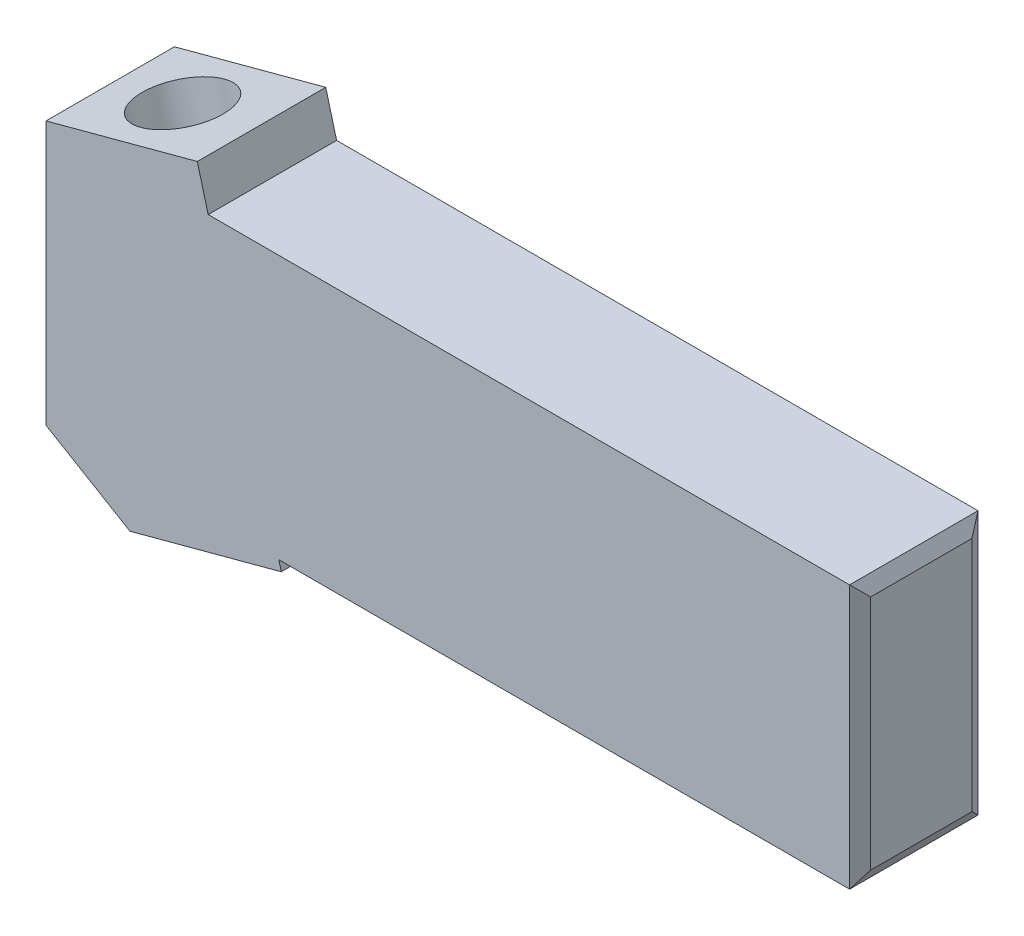
ISO-10303-21;
HEADER;
FILE_DESCRIPTION(('STEP AP214'),'2;1');
FILE_NAME('part.step','',(''),(''),'','','');
FILE_SCHEMA(('AUTOMOTIVE_DESIGN { 1 0 10303 214 1 1 1 1 }'));
ENDSEC;
DATA;
#1=APPLICATION_CONTEXT('core data for automotive mechanical design processes');
#2=APPLICATION_PROTOCOL_DEFINITION('international standard','automotive_design',2000,#1);
#3=PRODUCT_CONTEXT('',#1,'mechanical');
#4=PRODUCT('Part','Part','',(#3));
#5=PRODUCT_RELATED_PRODUCT_CATEGORY('part','',(#4));
#6=PRODUCT_DEFINITION_FORMATION('','',#4);
#7=PRODUCT_DEFINITION_CONTEXT('part definition',#1,'design');
#8=PRODUCT_DEFINITION('design','',#6,#7);
#9=PRODUCT_DEFINITION_SHAPE('','',#8);
#10=(LENGTH_UNIT() NAMED_UNIT(*) SI_UNIT(.MILLI.,.METRE.));
#11=(NAMED_UNIT(*) PLANE_ANGLE_UNIT() SI_UNIT($,.RADIAN.));
#12=(NAMED_UNIT(*) SI_UNIT($,.STERADIAN.) SOLID_ANGLE_UNIT());
#13=UNCERTAINTY_MEASURE_WITH_UNIT(LENGTH_MEASURE(1.E-05),#10,'distance_accuracy_value','');
#14=(GEOMETRIC_REPRESENTATION_CONTEXT(3) GLOBAL_UNCERTAINTY_ASSIGNED_CONTEXT((#13)) GLOBAL_UNIT_ASSIGNED_CONTEXT((#10,
#11,#12)) REPRESENTATION_CONTEXT('',''));
#15=CARTESIAN_POINT('',(0.,0.,0.));
#16=DIRECTION('',(0.,0.,1.));
#17=DIRECTION('',(1.,0.,0.));
#18=AXIS2_PLACEMENT_3D('',#15,#16,#17);
#19=CARTESIAN_POINT('',(0.,9.5,0.));
#20=DIRECTION('',(1.,0.,0.));
#21=DIRECTION('',(0.,0.,-1.));
#22=AXIS2_PLACEMENT_3D('',#19,#20,#21);
#23=PLANE('',#22);
#24=DIRECTION('',(0.,-1.,0.));
#25=VECTOR('',#24,1.);
#26=CARTESIAN_POINT('',(0.,9.5,-9.5));
#27=LINE('',#26,#25);
#28=CARTESIAN_POINT('',(0.,9.5,-9.5));
#29=VERTEX_POINT('',#28);
#30=CARTESIAN_POINT('',(0.,-10.,-9.5));
#31=VERTEX_POINT('',#30);
#32=EDGE_CURVE('E173',#29,#31,#27,.T.);
#33=ORIENTED_EDGE('',*,*,#32,.T.);
#34=DIRECTION('',(0.,0.,1.));
#35=VECTOR('',#34,1.);
#36=CARTESIAN_POINT('',(0.,-10.,0.));
#37=LINE('',#36,#35);
#38=CARTESIAN_POINT('',(0.,-10.,0.));
#39=VERTEX_POINT('',#38);
#40=EDGE_CURVE('E215',#31,#39,#37,.T.);
#41=ORIENTED_EDGE('',*,*,#40,.T.);
#42=DIRECTION('',(0.,-1.,0.));
#43=VECTOR('',#42,1.);
#44=CARTESIAN_POINT('',(0.,9.5,0.));
#45=LINE('',#44,#43);
#46=CARTESIAN_POINT('',(0.,9.5,0.));
#47=VERTEX_POINT('',#46);
#48=EDGE_CURVE('E134',#47,#39,#45,.T.);
#49=ORIENTED_EDGE('',*,*,#48,.F.);
#50=DIRECTION('',(0.,0.,1.));
#51=VECTOR('',#50,1.);
#52=CARTESIAN_POINT('',(0.,9.5,0.));
#53=LINE('',#52,#51);
#54=EDGE_CURVE('E165',#29,#47,#53,.T.);
#55=ORIENTED_EDGE('',*,*,#54,.F.);
#56=EDGE_LOOP('',(#33,#41,#49,#55));
#57=FACE_BOUND('',#56,.T.);
#58=ADVANCED_FACE('F33',(#57),#23,.F.);
#59=CARTESIAN_POINT('',(0.,9.5,0.));
#60=DIRECTION('',(0.,0.,-1.));
#61=DIRECTION('',(-1.,0.,0.));
#62=AXIS2_PLACEMENT_3D('',#59,#60,#61);
#63=PLANE('',#62);
#64=DIRECTION('',(1.,0.,0.));
#65=VECTOR('',#64,1.);
#66=CARTESIAN_POINT('',(0.,-10.,0.));
#67=LINE('',#66,#65);
#68=CARTESIAN_POINT('',(17.2228145805415,-10.,0.));
#69=VERTEX_POINT('',#68);
#70=CARTESIAN_POINT('',(59.4456909485472,-10.,0.));
#71=VERTEX_POINT('',#70);
#72=EDGE_CURVE('E217',#69,#71,#67,.T.);
#73=ORIENTED_EDGE('',*,*,#72,.T.);
#74=DIRECTION('',(0.,1.,0.));
#75=VECTOR('',#74,1.);
#76=CARTESIAN_POINT('',(59.4456909485472,9.5,0.));
#77=LINE('',#76,#75);
#78=CARTESIAN_POINT('',(59.4456909485472,9.5,0.));
#79=VERTEX_POINT('',#78);
#80=EDGE_CURVE('E192',#71,#79,#77,.T.);
#81=ORIENTED_EDGE('',*,*,#80,.T.);
#82=DIRECTION('',(1.,0.,0.));
#83=VECTOR('',#82,1.);
#84=CARTESIAN_POINT('',(0.,9.5,0.));
#85=LINE('',#84,#83);
#86=CARTESIAN_POINT('',(11.9978053281345,9.5,0.));
#87=VERTEX_POINT('',#86);
#88=EDGE_CURVE('E168',#87,#79,#85,.T.);
#89=ORIENTED_EDGE('',*,*,#88,.F.);
#90=DIRECTION('',(-0.258819045102523,0.965925826289068,0.));
#91=VECTOR('',#90,1.);
#92=CARTESIAN_POINT('',(17.4057618484402,-10.682768498904,0.));
#93=LINE('',#92,#91);
#94=CARTESIAN_POINT('',(11.1941047659796,12.4994513320337,0.));
#95=VERTEX_POINT('',#94);
#96=EDGE_CURVE('E126',#87,#95,#93,.T.);
#97=ORIENTED_EDGE('',*,*,#96,.T.);
#98=DIRECTION('',(0.965925826289068,0.258819045102523,0.));
#99=VECTOR('',#98,1.);
#100=CARTESIAN_POINT('',(0.,9.5,0.));
#101=LINE('',#100,#99);
#102=EDGE_CURVE('E154',#47,#95,#101,.T.);
#103=ORIENTED_EDGE('',*,*,#102,.F.);
#104=ORIENTED_EDGE('',*,*,#48,.T.);
#105=DIRECTION('',(-0.860216341580518,0.509929255561818,0.));
#106=VECTOR('',#105,1.);
#107=CARTESIAN_POINT('',(6.21165708246054,-13.6822198309376,0.));
#108=LINE('',#107,#106);
#109=CARTESIAN_POINT('',(6.21165708246054,-13.6822198309376,0.));
#110=VERTEX_POINT('',#109);
#111=EDGE_CURVE('E120',#110,#39,#108,.T.);
#112=ORIENTED_EDGE('',*,*,#111,.F.);
#113=DIRECTION('',(0.965925826289068,0.258819045102523,0.));
#114=VECTOR('',#113,1.);
#115=CARTESIAN_POINT('',(6.21165708246054,-13.6822198309376,0.));
#116=LINE('',#115,#114);
#117=CARTESIAN_POINT('',(17.4057618484402,-10.682768498904,0.));
#118=VERTEX_POINT('',#117);
#119=EDGE_CURVE('E127',#110,#118,#116,.T.);
#120=ORIENTED_EDGE('',*,*,#119,.T.);
#121=EDGE_CURVE('E157',#118,#69,#93,.T.);
#122=ORIENTED_EDGE('',*,*,#121,.T.);
#123=EDGE_LOOP('',(#73,#81,#89,#97,#103,#104,#112,#120,#122));
#124=FACE_BOUND('',#123,.T.);
#125=ADVANCED_FACE('F131',(#124),#63,.F.);
#126=CARTESIAN_POINT('',(60.,9.5,0.));
#127=DIRECTION('',(-1.,0.,0.));
#128=DIRECTION('',(0.,0.,1.));
#129=AXIS2_PLACEMENT_3D('',#126,#127,#128);
#130=PLANE('',#129);
#131=DIRECTION('',(0.,1.,0.));
#132=VECTOR('',#131,1.);
#133=CARTESIAN_POINT('',(60.,9.5,-8.49999999999998));
#134=LINE('',#133,#132);
#135=CARTESIAN_POINT('',(60.,-8.99999999999998,-8.49999999999998));
#136=VERTEX_POINT('',#135);
#137=CARTESIAN_POINT('',(60.,8.49999999999998,-8.49999999999998));
#138=VERTEX_POINT('',#137);
#139=EDGE_CURVE('E183',#136,#138,#134,.T.);
#140=ORIENTED_EDGE('',*,*,#139,.T.);
#141=DIRECTION('',(0.,0.,1.));
#142=VECTOR('',#141,1.);
#143=CARTESIAN_POINT('',(60.,8.49999999999998,0.));
#144=LINE('',#143,#142);
#145=CARTESIAN_POINT('',(60.,8.49999999999998,-1.00000000000002));
#146=VERTEX_POINT('',#145);
#147=EDGE_CURVE('E189',#138,#146,#144,.T.);
#148=ORIENTED_EDGE('',*,*,#147,.T.);
#149=DIRECTION('',(0.,-1.,0.));
#150=VECTOR('',#149,1.);
#151=CARTESIAN_POINT('',(60.,9.5,-1.00000000000002));
#152=LINE('',#151,#150);
#153=CARTESIAN_POINT('',(60.,-8.99999999999998,-1.00000000000002));
#154=VERTEX_POINT('',#153);
#155=EDGE_CURVE('E187',#146,#154,#152,.T.);
#156=ORIENTED_EDGE('',*,*,#155,.T.);
#157=DIRECTION('',(0.,0.,-1.));
#158=VECTOR('',#157,1.);
#159=CARTESIAN_POINT('',(60.,-8.99999999999998,-9.5));
#160=LINE('',#159,#158);
#161=EDGE_CURVE('E185',#154,#136,#160,.T.);
#162=ORIENTED_EDGE('',*,*,#161,.T.);
#163=EDGE_LOOP('',(#140,#148,#156,#162));
#164=FACE_BOUND('',#163,.T.);
#165=ADVANCED_FACE('F248',(#164),#130,.F.);
#166=CARTESIAN_POINT('',(0.,9.5,-9.5));
#167=DIRECTION('',(0.,0.,1.));
#168=DIRECTION('',(1.,0.,0.));
#169=AXIS2_PLACEMENT_3D('',#166,#167,#168);
#170=PLANE('',#169);
#171=DIRECTION('',(-1.,0.,0.));
#172=VECTOR('',#171,1.);
#173=CARTESIAN_POINT('',(0.,9.5,-9.5));
#174=LINE('',#173,#172);
#175=CARTESIAN_POINT('',(59.4456909485472,9.5,-9.5));
#176=VERTEX_POINT('',#175);
#177=CARTESIAN_POINT('',(11.9978053281345,9.5,-9.5));
#178=VERTEX_POINT('',#177);
#179=EDGE_CURVE('E171',#176,#178,#174,.T.);
#180=ORIENTED_EDGE('',*,*,#179,.F.);
#181=DIRECTION('',(0.,-1.,0.));
#182=VECTOR('',#181,1.);
#183=CARTESIAN_POINT('',(59.4456909485472,9.5,-9.5));
#184=LINE('',#183,#182);
#185=CARTESIAN_POINT('',(59.4456909485472,-10.,-9.5));
#186=VERTEX_POINT('',#185);
#187=EDGE_CURVE('E11',#176,#186,#184,.T.);
#188=ORIENTED_EDGE('',*,*,#187,.T.);
#189=DIRECTION('',(-1.,0.,0.));
#190=VECTOR('',#189,1.);
#191=CARTESIAN_POINT('',(0.,-10.,-9.5));
#192=LINE('',#191,#190);
#193=CARTESIAN_POINT('',(17.2228145805415,-10.,-9.5));
#194=VERTEX_POINT('',#193);
#195=EDGE_CURVE('E151',#186,#194,#192,.T.);
#196=ORIENTED_EDGE('',*,*,#195,.T.);
#197=DIRECTION('',(-0.258819045102523,0.965925826289068,0.));
#198=VECTOR('',#197,1.);
#199=CARTESIAN_POINT('',(17.4057618484402,-10.682768498904,-9.5));
#200=LINE('',#199,#198);
#201=CARTESIAN_POINT('',(17.4057618484402,-10.682768498904,-9.5));
#202=VERTEX_POINT('',#201);
#203=EDGE_CURVE('E160',#202,#194,#200,.T.);
#204=ORIENTED_EDGE('',*,*,#203,.F.);
#205=DIRECTION('',(0.965925826289068,0.258819045102523,0.));
#206=VECTOR('',#205,1.);
#207=CARTESIAN_POINT('',(6.21165708246054,-13.6822198309376,-9.5));
#208=LINE('',#207,#206);
#209=CARTESIAN_POINT('',(6.21165708246054,-13.6822198309376,-9.5));
#210=VERTEX_POINT('',#209);
#211=EDGE_CURVE('E143',#210,#202,#208,.T.);
#212=ORIENTED_EDGE('',*,*,#211,.F.);
#213=DIRECTION('',(-0.860216341580518,0.509929255561818,0.));
#214=VECTOR('',#213,1.);
#215=CARTESIAN_POINT('',(6.21165708246054,-13.6822198309376,-9.5));
#216=LINE('',#215,#214);
#217=EDGE_CURVE('E122',#210,#31,#216,.T.);
#218=ORIENTED_EDGE('',*,*,#217,.T.);
#219=ORIENTED_EDGE('',*,*,#32,.F.);
#220=DIRECTION('',(0.965925826289068,0.258819045102523,0.));
#221=VECTOR('',#220,1.);
#222=CARTESIAN_POINT('',(0.,9.5,-9.5));
#223=LINE('',#222,#221);
#224=CARTESIAN_POINT('',(11.1941047659796,12.4994513320337,-9.5));
#225=VERTEX_POINT('',#224);
#226=EDGE_CURVE('E147',#29,#225,#223,.T.);
#227=ORIENTED_EDGE('',*,*,#226,.T.);
#228=EDGE_CURVE('E159',#178,#225,#200,.T.);
#229=ORIENTED_EDGE('',*,*,#228,.F.);
#230=EDGE_LOOP('',(#180,#188,#196,#204,#212,#218,#219,#227,#229));
#231=FACE_BOUND('',#230,.T.);
#232=ADVANCED_FACE('F220',(#231),#170,.F.);
#233=CARTESIAN_POINT('',(0.,9.5,0.));
#234=DIRECTION('',(0.,-1.,0.));
#235=DIRECTION('',(0.,0.,-1.));
#236=AXIS2_PLACEMENT_3D('',#233,#234,#235);
#237=PLANE('',#236);
#238=ORIENTED_EDGE('',*,*,#88,.T.);
#239=DIRECTION('',(0.,0.,-1.));
#240=VECTOR('',#239,1.);
#241=CARTESIAN_POINT('',(59.4456909485472,9.5,0.));
#242=LINE('',#241,#240);
#243=EDGE_CURVE('E180',#79,#176,#242,.T.);
#244=ORIENTED_EDGE('',*,*,#243,.T.);
#245=ORIENTED_EDGE('',*,*,#179,.T.);
#246=DIRECTION('',(0.,0.,1.));
#247=VECTOR('',#246,1.);
#248=CARTESIAN_POINT('',(11.9978053281345,9.5,0.));
#249=LINE('',#248,#247);
#250=EDGE_CURVE('E163',#178,#87,#249,.T.);
#251=ORIENTED_EDGE('',*,*,#250,.T.);
#252=EDGE_LOOP('',(#238,#244,#245,#251));
#253=FACE_BOUND('',#252,.T.);
#254=ADVANCED_FACE('F232',(#253),#237,.F.);
#255=CARTESIAN_POINT('',(3.83665708246052,-14.3185991629616,0.));
#256=DIRECTION('',(-0.258819045102523,0.965925826289068,0.));
#257=DIRECTION('',(-0.965925826289068,-0.258819045102523,0.));
#258=AXIS2_PLACEMENT_3D('',#255,#256,#257);
#259=PLANE('',#258);
#260=CARTESIAN_POINT('',(11.5640636927731,-12.2480468021414,-4.75));
#261=DIRECTION('',(-0.258819045102523,0.965925826289068,0.));
#262=DIRECTION('',(-0.965925826289068,-0.258819045102523,0.));
#263=AXIS2_PLACEMENT_3D('',#260,#261,#262);
#264=CIRCLE('',#263,3.1);
#265=CARTESIAN_POINT('',(8.56969363127695,-13.0503858419592,-4.75));
#266=VERTEX_POINT('',#265);
#267=EDGE_CURVE('E212',#266,#266,#264,.T.);
#268=ORIENTED_EDGE('',*,*,#267,.T.);
#269=EDGE_LOOP('',(#268));
#270=FACE_BOUND('',#269,.T.);
#271=ORIENTED_EDGE('',*,*,#211,.T.);
#272=DIRECTION('',(0.,0.,-1.));
#273=VECTOR('',#272,1.);
#274=CARTESIAN_POINT('',(17.4057618484402,-10.682768498904,0.));
#275=LINE('',#274,#273);
#276=EDGE_CURVE('E141',#118,#202,#275,.T.);
#277=ORIENTED_EDGE('',*,*,#276,.F.);
#278=ORIENTED_EDGE('',*,*,#119,.F.);
#279=DIRECTION('',(0.,0.,-1.));
#280=VECTOR('',#279,1.);
#281=CARTESIAN_POINT('',(6.21165708246054,-13.6822198309376,0.));
#282=LINE('',#281,#280);
#283=EDGE_CURVE('E116',#110,#210,#282,.T.);
#284=ORIENTED_EDGE('',*,*,#283,.T.);
#285=EDGE_LOOP('',(#271,#277,#278,#284));
#286=FACE_BOUND('',#285,.T.);
#287=ADVANCED_FACE('F139',(#270,#286),#259,.F.);
#288=CARTESIAN_POINT('',(17.4057618484402,-10.682768498904,0.));
#289=DIRECTION('',(0.965925826289068,0.258819045102523,0.));
#290=DIRECTION('',(-0.258819045102523,0.965925826289068,0.));
#291=AXIS2_PLACEMENT_3D('',#288,#289,#290);
#292=PLANE('',#291);
#293=DIRECTION('',(0.,0.,-1.));
#294=VECTOR('',#293,1.);
#295=CARTESIAN_POINT('',(17.2228145805415,-10.,0.));
#296=LINE('',#295,#294);
#297=EDGE_CURVE('E177',#69,#194,#296,.T.);
#298=ORIENTED_EDGE('',*,*,#297,.F.);
#299=ORIENTED_EDGE('',*,*,#121,.F.);
#300=ORIENTED_EDGE('',*,*,#276,.T.);
#301=ORIENTED_EDGE('',*,*,#203,.T.);
#302=EDGE_LOOP('',(#298,#299,#300,#301));
#303=FACE_BOUND('',#302,.T.);
#304=ADVANCED_FACE('F222',(#303),#292,.T.);
#305=ORIENTED_EDGE('',*,*,#250,.F.);
#306=ORIENTED_EDGE('',*,*,#228,.T.);
#307=DIRECTION('',(0.,0.,-1.));
#308=VECTOR('',#307,1.);
#309=CARTESIAN_POINT('',(11.1941047659796,12.4994513320337,0.));
#310=LINE('',#309,#308);
#311=EDGE_CURVE('E150',#95,#225,#310,.T.);
#312=ORIENTED_EDGE('',*,*,#311,.F.);
#313=ORIENTED_EDGE('',*,*,#96,.F.);
#314=EDGE_LOOP('',(#305,#306,#312,#313));
#315=FACE_BOUND('',#314,.T.);
#316=ADVANCED_FACE('F236',(#315),#292,.T.);
#317=CARTESIAN_POINT('',(-2.37500000000002,8.86362066797608,0.));
#318=DIRECTION('',(-0.258819045102523,0.965925826289068,0.));
#319=DIRECTION('',(-0.965925826289068,-0.258819045102523,0.));
#320=AXIS2_PLACEMENT_3D('',#317,#318,#319);
#321=PLANE('',#320);
#322=CARTESIAN_POINT('',(5.35240661031253,10.9341730287963,-4.75));
#323=DIRECTION('',(-0.258819045102522,0.965925826289068,0.));
#324=DIRECTION('',(-0.965925826289068,-0.258819045102522,0.));
#325=AXIS2_PLACEMENT_3D('',#322,#323,#324);
#326=CIRCLE('',#325,3.1);
#327=CARTESIAN_POINT('',(2.35803654881641,10.1318339889784,-4.75));
#328=VERTEX_POINT('',#327);
#329=EDGE_CURVE('E136',#328,#328,#326,.T.);
#330=ORIENTED_EDGE('',*,*,#329,.F.);
#331=EDGE_LOOP('',(#330));
#332=FACE_BOUND('',#331,.T.);
#333=ORIENTED_EDGE('',*,*,#226,.F.);
#334=ORIENTED_EDGE('',*,*,#54,.T.);
#335=ORIENTED_EDGE('',*,*,#102,.T.);
#336=ORIENTED_EDGE('',*,*,#311,.T.);
#337=EDGE_LOOP('',(#333,#334,#335,#336));
#338=FACE_BOUND('',#337,.T.);
#339=ADVANCED_FACE('F241',(#332,#338),#321,.T.);
#340=CARTESIAN_POINT('',(0.,-10.,0.));
#341=DIRECTION('',(0.,-1.,0.));
#342=DIRECTION('',(0.,0.,-1.));
#343=AXIS2_PLACEMENT_3D('',#340,#341,#342);
#344=PLANE('',#343);
#345=ORIENTED_EDGE('',*,*,#195,.F.);
#346=DIRECTION('',(0.,0.,1.));
#347=VECTOR('',#346,1.);
#348=CARTESIAN_POINT('',(59.4456909485472,-10.,0.));
#349=LINE('',#348,#347);
#350=EDGE_CURVE('E42',#186,#71,#349,.T.);
#351=ORIENTED_EDGE('',*,*,#350,.T.);
#352=ORIENTED_EDGE('',*,*,#72,.F.);
#353=ORIENTED_EDGE('',*,*,#297,.T.);
#354=EDGE_LOOP('',(#345,#351,#352,#353));
#355=FACE_BOUND('',#354,.T.);
#356=ADVANCED_FACE('F223',(#355),#344,.T.);
#357=CARTESIAN_POINT('',(15.1671994545139,-25.6951325315263,-4.75));
#358=DIRECTION('',(-0.258819045102522,0.965925826289068,0.));
#359=DIRECTION('',(-0.965925826289068,-0.258819045102522,0.));
#360=AXIS2_PLACEMENT_3D('',#357,#358,#359);
#361=CYLINDRICAL_SURFACE('',#360,3.1);
#362=ORIENTED_EDGE('',*,*,#329,.T.);
#363=EDGE_LOOP('',(#362));
#364=FACE_BOUND('',#363,.T.);
#365=ORIENTED_EDGE('',*,*,#267,.F.);
#366=EDGE_LOOP('',(#365));
#367=FACE_BOUND('',#366,.T.);
#368=ADVANCED_FACE('F265',(#364,#367),#361,.F.);
#369=CARTESIAN_POINT('',(6.21165708246054,-13.6822198309376,0.));
#370=DIRECTION('',(-0.509929255561818,-0.860216341580518,0.));
#371=DIRECTION('',(0.860216341580518,-0.509929255561818,0.));
#372=AXIS2_PLACEMENT_3D('',#369,#370,#371);
#373=PLANE('',#372);
#374=ORIENTED_EDGE('',*,*,#217,.F.);
#375=ORIENTED_EDGE('',*,*,#283,.F.);
#376=ORIENTED_EDGE('',*,*,#111,.T.);
#377=ORIENTED_EDGE('',*,*,#40,.F.);
#378=EDGE_LOOP('',(#374,#375,#376,#377));
#379=FACE_BOUND('',#378,.T.);
#380=ADVANCED_FACE('F118',(#379),#373,.T.);
#381=CARTESIAN_POINT('',(60.,-8.99999999999998,0.));
#382=DIRECTION('',(0.874619707139398,-0.484809620246333,0.));
#383=DIRECTION('',(0.,0.,1.));
#384=AXIS2_PLACEMENT_3D('',#381,#382,#383);
#385=PLANE('',#384);
#386=DIRECTION('',(0.364925188258718,0.658342466720148,0.658342466720148));
#387=VECTOR('',#386,1.);
#388=CARTESIAN_POINT('',(64.1304830463751,-1.54841133200019,-1.04841133200019));
#389=LINE('',#388,#387);
#390=EDGE_CURVE('E198',#136,#186,#389,.F.);
#391=ORIENTED_EDGE('',*,*,#390,.F.);
#392=ORIENTED_EDGE('',*,*,#161,.F.);
#393=DIRECTION('',(0.364925188258718,0.658342466720148,-0.658342466720148));
#394=VECTOR('',#393,1.);
#395=CARTESIAN_POINT('',(59.7597542513934,-9.43341480348716,-0.566585196512843));
#396=LINE('',#395,#394);
#397=EDGE_CURVE('E37',#71,#154,#396,.T.);
#398=ORIENTED_EDGE('',*,*,#397,.F.);
#399=ORIENTED_EDGE('',*,*,#350,.F.);
#400=EDGE_LOOP('',(#391,#392,#398,#399));
#401=FACE_BOUND('',#400,.T.);
#402=ADVANCED_FACE('F35',(#401),#385,.T.);
#403=CARTESIAN_POINT('',(60.,9.5,-1.00000000000002));
#404=DIRECTION('',(-0.874619707139398,0.,-0.484809620246333));
#405=DIRECTION('',(0.,-1.,0.));
#406=AXIS2_PLACEMENT_3D('',#403,#404,#405);
#407=PLANE('',#406);
#408=ORIENTED_EDGE('',*,*,#397,.T.);
#409=ORIENTED_EDGE('',*,*,#155,.F.);
#410=DIRECTION('',(-0.364925188258718,0.658342466720148,0.658342466720148));
#411=VECTOR('',#410,1.);
#412=CARTESIAN_POINT('',(59.7597542513934,8.93341480348716,-0.566585196512843));
#413=LINE('',#412,#411);
#414=EDGE_CURVE('E197',#79,#146,#413,.F.);
#415=ORIENTED_EDGE('',*,*,#414,.F.);
#416=ORIENTED_EDGE('',*,*,#80,.F.);
#417=EDGE_LOOP('',(#408,#409,#415,#416));
#418=FACE_BOUND('',#417,.T.);
#419=ADVANCED_FACE('F227',(#418),#407,.F.);
#420=CARTESIAN_POINT('',(59.4456909485472,9.5,-9.5));
#421=DIRECTION('',(-0.874619707139398,0.,0.484809620246333));
#422=DIRECTION('',(0.,-1.,0.));
#423=AXIS2_PLACEMENT_3D('',#420,#421,#422);
#424=PLANE('',#423);
#425=ORIENTED_EDGE('',*,*,#390,.T.);
#426=ORIENTED_EDGE('',*,*,#187,.F.);
#427=DIRECTION('',(0.364925188258718,-0.658342466720148,0.658342466720148));
#428=VECTOR('',#427,1.);
#429=CARTESIAN_POINT('',(59.4456909485472,9.5,-9.5));
#430=LINE('',#429,#428);
#431=EDGE_CURVE('E195',#138,#176,#430,.F.);
#432=ORIENTED_EDGE('',*,*,#431,.F.);
#433=ORIENTED_EDGE('',*,*,#139,.F.);
#434=EDGE_LOOP('',(#425,#426,#432,#433));
#435=FACE_BOUND('',#434,.T.);
#436=ADVANCED_FACE('F255',(#435),#424,.F.);
#437=CARTESIAN_POINT('',(59.4456909485472,9.5,0.));
#438=DIRECTION('',(-0.874619707139398,-0.484809620246333,0.));
#439=DIRECTION('',(0.,0.,-1.));
#440=AXIS2_PLACEMENT_3D('',#437,#438,#439);
#441=PLANE('',#440);
#442=ORIENTED_EDGE('',*,*,#414,.T.);
#443=ORIENTED_EDGE('',*,*,#147,.F.);
#444=ORIENTED_EDGE('',*,*,#431,.T.);
#445=ORIENTED_EDGE('',*,*,#243,.F.);
#446=EDGE_LOOP('',(#442,#443,#444,#445));
#447=FACE_BOUND('',#446,.T.);
#448=ADVANCED_FACE('F252',(#447),#441,.F.);
#449=CLOSED_SHELL('',(#58,#125,#165,#232,#254,#287,#304,#316,#339,#356,#368,#380,#402,#419,#436,#448));
#450=MANIFOLD_SOLID_BREP('B2',#449);
#451=ADVANCED_BREP_SHAPE_REPRESENTATION('',(#18,#450),#14);
#452=SHAPE_DEFINITION_REPRESENTATION(#9,#451);
ENDSEC;
END-ISO-10303-21;
